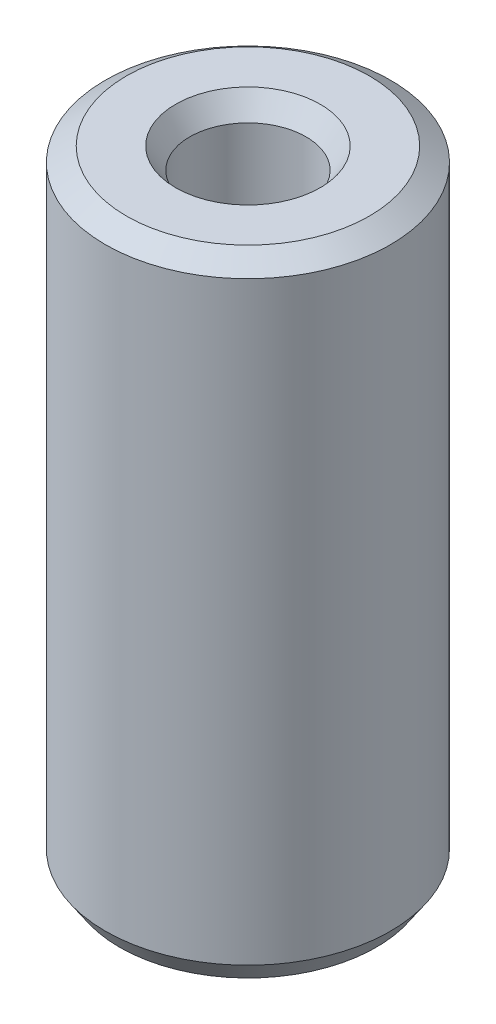
ISO-10303-21;
HEADER;
FILE_DESCRIPTION(('STEP AP214'),'2;1');
FILE_NAME('part.step','',(''),(''),'','','');
FILE_SCHEMA(('AUTOMOTIVE_DESIGN { 1 0 10303 214 1 1 1 1 }'));
ENDSEC;
DATA;
#1=APPLICATION_CONTEXT('core data for automotive mechanical design processes');
#2=APPLICATION_PROTOCOL_DEFINITION('international standard','automotive_design',2000,#1);
#3=PRODUCT_CONTEXT('',#1,'mechanical');
#4=PRODUCT('Part','Part','',(#3));
#5=PRODUCT_RELATED_PRODUCT_CATEGORY('part','',(#4));
#6=PRODUCT_DEFINITION_FORMATION('','',#4);
#7=PRODUCT_DEFINITION_CONTEXT('part definition',#1,'design');
#8=PRODUCT_DEFINITION('design','',#6,#7);
#9=PRODUCT_DEFINITION_SHAPE('','',#8);
#10=(LENGTH_UNIT() NAMED_UNIT(*) SI_UNIT(.MILLI.,.METRE.));
#11=(NAMED_UNIT(*) PLANE_ANGLE_UNIT() SI_UNIT($,.RADIAN.));
#12=(NAMED_UNIT(*) SI_UNIT($,.STERADIAN.) SOLID_ANGLE_UNIT());
#13=UNCERTAINTY_MEASURE_WITH_UNIT(LENGTH_MEASURE(1.E-05),#10,'distance_accuracy_value','');
#14=(GEOMETRIC_REPRESENTATION_CONTEXT(3) GLOBAL_UNCERTAINTY_ASSIGNED_CONTEXT((#13)) GLOBAL_UNIT_ASSIGNED_CONTEXT((#10,
#11,#12)) REPRESENTATION_CONTEXT('',''));
#15=CARTESIAN_POINT('',(0.,0.,0.));
#16=DIRECTION('',(0.,0.,1.));
#17=DIRECTION('',(1.,0.,0.));
#18=AXIS2_PLACEMENT_3D('',#15,#16,#17);
#19=CARTESIAN_POINT('',(0.,176.740717101355,0.));
#20=DIRECTION('',(0.,-1.,0.));
#21=DIRECTION('',(0.,0.,-1.));
#22=AXIS2_PLACEMENT_3D('',#19,#20,#21);
#23=CYLINDRICAL_SURFACE('',#22,40.);
#24=CARTESIAN_POINT('',(0.,5.91723726787038,0.));
#25=DIRECTION('',(0.,1.,0.));
#26=DIRECTION('',(0.,0.,1.));
#27=AXIS2_PLACEMENT_3D('',#24,#25,#26);
#28=CIRCLE('',#27,40.);
#29=CARTESIAN_POINT('',(0.,5.91723726787038,40.));
#30=VERTEX_POINT('',#29);
#31=EDGE_CURVE('E10',#30,#30,#28,.T.);
#32=ORIENTED_EDGE('',*,*,#31,.T.);
#33=EDGE_LOOP('',(#32));
#34=FACE_BOUND('',#33,.T.);
#35=CARTESIAN_POINT('',(0.,172.757044554975,0.));
#36=DIRECTION('',(0.,1.,0.));
#37=DIRECTION('',(0.,0.,1.));
#38=AXIS2_PLACEMENT_3D('',#35,#36,#37);
#39=CIRCLE('',#38,40.);
#40=CARTESIAN_POINT('',(0.,172.757044554975,40.));
#41=VERTEX_POINT('',#40);
#42=EDGE_CURVE('E50',#41,#41,#39,.F.);
#43=ORIENTED_EDGE('',*,*,#42,.T.);
#44=EDGE_LOOP('',(#43));
#45=FACE_BOUND('',#44,.T.);
#46=ADVANCED_FACE('F39',(#34,#45),#23,.T.);
#47=CARTESIAN_POINT('',(0.,176.740717101355,0.));
#48=DIRECTION('',(0.,1.,0.));
#49=DIRECTION('',(0.,0.,1.));
#50=AXIS2_PLACEMENT_3D('',#47,#48,#49);
#51=PLANE('',#50);
#52=CARTESIAN_POINT('',(0.,176.740717101355,0.));
#53=DIRECTION('',(0.,1.,0.));
#54=DIRECTION('',(0.,0.,1.));
#55=AXIS2_PLACEMENT_3D('',#52,#53,#54);
#56=CIRCLE('',#55,20.2996190497597);
#57=CARTESIAN_POINT('',(0.,176.740717101355,20.2996190497597));
#58=VERTEX_POINT('',#57);
#59=EDGE_CURVE('E58',#58,#58,#56,.F.);
#60=ORIENTED_EDGE('',*,*,#59,.T.);
#61=EDGE_LOOP('',(#60));
#62=FACE_BOUND('',#61,.T.);
#63=CARTESIAN_POINT('',(0.,176.740717101355,0.));
#64=DIRECTION('',(0.,1.,0.));
#65=DIRECTION('',(0.,0.,1.));
#66=AXIS2_PLACEMENT_3D('',#63,#64,#65);
#67=CIRCLE('',#66,34.0827627321296);
#68=CARTESIAN_POINT('',(0.,176.740717101355,34.0827627321296));
#69=VERTEX_POINT('',#68);
#70=EDGE_CURVE('E61',#69,#69,#67,.T.);
#71=ORIENTED_EDGE('',*,*,#70,.T.);
#72=EDGE_LOOP('',(#71));
#73=FACE_BOUND('',#72,.T.);
#74=ADVANCED_FACE('F88',(#62,#73),#51,.T.);
#75=CARTESIAN_POINT('',(0.,0.,0.));
#76=DIRECTION('',(0.,1.,0.));
#77=DIRECTION('',(0.,0.,1.));
#78=AXIS2_PLACEMENT_3D('',#75,#76,#77);
#79=PLANE('',#78);
#80=CARTESIAN_POINT('',(0.,0.,0.));
#81=DIRECTION('',(0.,1.,0.));
#82=DIRECTION('',(0.,0.,1.));
#83=AXIS2_PLACEMENT_3D('',#80,#81,#82);
#84=CIRCLE('',#83,22.233183771251);
#85=CARTESIAN_POINT('',(0.,0.,22.233183771251));
#86=VERTEX_POINT('',#85);
#87=EDGE_CURVE('E51',#86,#86,#84,.T.);
#88=ORIENTED_EDGE('',*,*,#87,.T.);
#89=EDGE_LOOP('',(#88));
#90=FACE_BOUND('',#89,.T.);
#91=CARTESIAN_POINT('',(0.,0.,0.));
#92=DIRECTION('',(0.,1.,0.));
#93=DIRECTION('',(0.,0.,1.));
#94=AXIS2_PLACEMENT_3D('',#91,#92,#93);
#95=CIRCLE('',#94,36.0163274536209);
#96=CARTESIAN_POINT('',(0.,0.,36.0163274536209));
#97=VERTEX_POINT('',#96);
#98=EDGE_CURVE('E54',#97,#97,#95,.F.);
#99=ORIENTED_EDGE('',*,*,#98,.T.);
#100=EDGE_LOOP('',(#99));
#101=FACE_BOUND('',#100,.T.);
#102=ADVANCED_FACE('F83',(#90,#101),#79,.F.);
#103=CARTESIAN_POINT('',(0.,176.740717101355,0.));
#104=DIRECTION('',(0.,-1.,0.));
#105=DIRECTION('',(0.,0.,-1.));
#106=AXIS2_PLACEMENT_3D('',#103,#104,#105);
#107=CYLINDRICAL_SURFACE('',#106,16.3159465033807);
#108=CARTESIAN_POINT('',(0.,170.823479833484,0.));
#109=DIRECTION('',(0.,1.,0.));
#110=DIRECTION('',(0.,0.,1.));
#111=AXIS2_PLACEMENT_3D('',#108,#109,#110);
#112=CIRCLE('',#111,16.3159465033807);
#113=CARTESIAN_POINT('',(0.,170.823479833484,16.3159465033807));
#114=VERTEX_POINT('',#113);
#115=EDGE_CURVE('E67',#114,#114,#112,.T.);
#116=ORIENTED_EDGE('',*,*,#115,.T.);
#117=EDGE_LOOP('',(#116));
#118=FACE_BOUND('',#117,.T.);
#119=CARTESIAN_POINT('',(0.,3.98367254637902,0.));
#120=DIRECTION('',(0.,1.,0.));
#121=DIRECTION('',(0.,0.,1.));
#122=AXIS2_PLACEMENT_3D('',#119,#120,#121);
#123=CIRCLE('',#122,16.3159465033807);
#124=CARTESIAN_POINT('',(0.,3.98367254637902,16.3159465033807));
#125=VERTEX_POINT('',#124);
#126=EDGE_CURVE('E69',#125,#125,#123,.F.);
#127=ORIENTED_EDGE('',*,*,#126,.T.);
#128=EDGE_LOOP('',(#127));
#129=FACE_BOUND('',#128,.T.);
#130=ADVANCED_FACE('F71',(#118,#129),#107,.F.);
#131=CARTESIAN_POINT('',(0.,170.823479833484,0.));
#132=DIRECTION('',(0.,1.,0.));
#133=DIRECTION('',(0.,0.,1.));
#134=AXIS2_PLACEMENT_3D('',#131,#132,#133);
#135=CONICAL_SURFACE('',#134,16.3159465033807,0.592533963550249);
#136=ORIENTED_EDGE('',*,*,#59,.F.);
#137=EDGE_LOOP('',(#136));
#138=FACE_BOUND('',#137,.T.);
#139=ORIENTED_EDGE('',*,*,#115,.F.);
#140=EDGE_LOOP('',(#139));
#141=FACE_BOUND('',#140,.T.);
#142=ADVANCED_FACE('F77',(#138,#141),#135,.F.);
#143=CARTESIAN_POINT('',(0.,0.,0.));
#144=DIRECTION('',(0.,-1.,0.));
#145=DIRECTION('',(0.,0.,-1.));
#146=AXIS2_PLACEMENT_3D('',#143,#144,#145);
#147=CONICAL_SURFACE('',#146,22.233183771251,0.97826236324465);
#148=ORIENTED_EDGE('',*,*,#126,.F.);
#149=EDGE_LOOP('',(#148));
#150=FACE_BOUND('',#149,.T.);
#151=ORIENTED_EDGE('',*,*,#87,.F.);
#152=EDGE_LOOP('',(#151));
#153=FACE_BOUND('',#152,.T.);
#154=ADVANCED_FACE('F73',(#150,#153),#147,.F.);
#155=CARTESIAN_POINT('',(0.,5.91723726787038,0.));
#156=DIRECTION('',(0.,1.,0.));
#157=DIRECTION('',(0.,0.,1.));
#158=AXIS2_PLACEMENT_3D('',#155,#156,#157);
#159=CONICAL_SURFACE('',#158,40.,0.592533963550244);
#160=ORIENTED_EDGE('',*,*,#98,.F.);
#161=EDGE_LOOP('',(#160));
#162=FACE_BOUND('',#161,.T.);
#163=ORIENTED_EDGE('',*,*,#31,.F.);
#164=EDGE_LOOP('',(#163));
#165=FACE_BOUND('',#164,.T.);
#166=ADVANCED_FACE('F76',(#162,#165),#159,.T.);
#167=CARTESIAN_POINT('',(0.,176.740717101355,0.));
#168=DIRECTION('',(0.,-1.,0.));
#169=DIRECTION('',(0.,0.,-1.));
#170=AXIS2_PLACEMENT_3D('',#167,#168,#169);
#171=CONICAL_SURFACE('',#170,34.0827627321296,0.978262363244653);
#172=ORIENTED_EDGE('',*,*,#42,.F.);
#173=EDGE_LOOP('',(#172));
#174=FACE_BOUND('',#173,.T.);
#175=ORIENTED_EDGE('',*,*,#70,.F.);
#176=EDGE_LOOP('',(#175));
#177=FACE_BOUND('',#176,.T.);
#178=ADVANCED_FACE('F45',(#174,#177),#171,.T.);
#179=CLOSED_SHELL('',(#46,#74,#102,#130,#142,#154,#166,#178));
#180=MANIFOLD_SOLID_BREP('B2',#179);
#181=ADVANCED_BREP_SHAPE_REPRESENTATION('',(#18,#180),#14);
#182=SHAPE_DEFINITION_REPRESENTATION(#9,#181);
ENDSEC;
END-ISO-10303-21;
